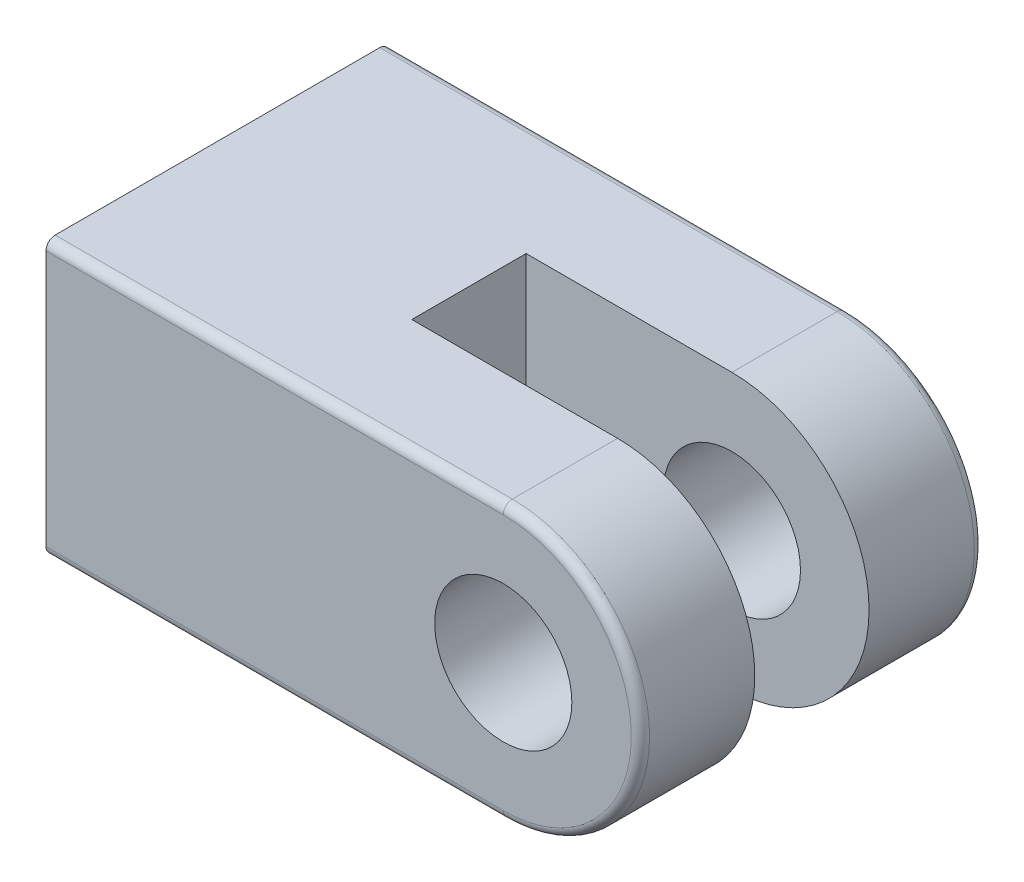
ISO-10303-21;
HEADER;
FILE_DESCRIPTION(('STEP AP214'),'2;1');
FILE_NAME('part.step','',(''),(''),'','','');
FILE_SCHEMA(('AUTOMOTIVE_DESIGN { 1 0 10303 214 1 1 1 1 }'));
ENDSEC;
DATA;
#1=APPLICATION_CONTEXT('core data for automotive mechanical design processes');
#2=APPLICATION_PROTOCOL_DEFINITION('international standard','automotive_design',2000,#1);
#3=PRODUCT_CONTEXT('',#1,'mechanical');
#4=PRODUCT('Part','Part','',(#3));
#5=PRODUCT_RELATED_PRODUCT_CATEGORY('part','',(#4));
#6=PRODUCT_DEFINITION_FORMATION('','',#4);
#7=PRODUCT_DEFINITION_CONTEXT('part definition',#1,'design');
#8=PRODUCT_DEFINITION('design','',#6,#7);
#9=PRODUCT_DEFINITION_SHAPE('','',#8);
#10=(LENGTH_UNIT() NAMED_UNIT(*) SI_UNIT(.MILLI.,.METRE.));
#11=(NAMED_UNIT(*) PLANE_ANGLE_UNIT() SI_UNIT($,.RADIAN.));
#12=(NAMED_UNIT(*) SI_UNIT($,.STERADIAN.) SOLID_ANGLE_UNIT());
#13=UNCERTAINTY_MEASURE_WITH_UNIT(LENGTH_MEASURE(1.E-05),#10,'distance_accuracy_value','');
#14=(GEOMETRIC_REPRESENTATION_CONTEXT(3) GLOBAL_UNCERTAINTY_ASSIGNED_CONTEXT((#13)) GLOBAL_UNIT_ASSIGNED_CONTEXT((#10,
#11,#12)) REPRESENTATION_CONTEXT('',''));
#15=CARTESIAN_POINT('',(0.,0.,0.));
#16=DIRECTION('',(0.,0.,1.));
#17=DIRECTION('',(1.,0.,0.));
#18=AXIS2_PLACEMENT_3D('',#15,#16,#17);
#19=CARTESIAN_POINT('',(0.,0.,19.05));
#20=DIRECTION('',(0.,0.,-1.));
#21=DIRECTION('',(-1.,0.,0.));
#22=AXIS2_PLACEMENT_3D('',#19,#20,#21);
#23=CYLINDRICAL_SURFACE('',#22,7.62);
#24=DIRECTION('',(0.,0.,-1.));
#25=VECTOR('',#24,1.);
#26=CARTESIAN_POINT('',(0.,7.62,19.05));
#27=LINE('',#26,#25);
#28=CARTESIAN_POINT('',(0.,7.62,18.542));
#29=VERTEX_POINT('',#28);
#30=CARTESIAN_POINT('',(0.,7.62,12.7));
#31=VERTEX_POINT('',#30);
#32=EDGE_CURVE('E182',#29,#31,#27,.T.);
#33=ORIENTED_EDGE('',*,*,#32,.F.);
#34=CARTESIAN_POINT('',(0.,0.,18.542));
#35=DIRECTION('',(0.,0.,1.));
#36=DIRECTION('',(1.,0.,0.));
#37=AXIS2_PLACEMENT_3D('',#34,#35,#36);
#38=CIRCLE('',#37,7.62);
#39=CARTESIAN_POINT('',(0.,-7.62,18.542));
#40=VERTEX_POINT('',#39);
#41=EDGE_CURVE('E11',#29,#40,#38,.F.);
#42=ORIENTED_EDGE('',*,*,#41,.T.);
#43=DIRECTION('',(0.,0.,-1.));
#44=VECTOR('',#43,1.);
#45=CARTESIAN_POINT('',(0.,-7.62,19.05));
#46=LINE('',#45,#44);
#47=CARTESIAN_POINT('',(0.,-7.62,12.7));
#48=VERTEX_POINT('',#47);
#49=EDGE_CURVE('E173',#40,#48,#46,.T.);
#50=ORIENTED_EDGE('',*,*,#49,.T.);
#51=CARTESIAN_POINT('',(0.,0.,12.7));
#52=DIRECTION('',(0.,0.,1.));
#53=DIRECTION('',(1.,0.,0.));
#54=AXIS2_PLACEMENT_3D('',#51,#52,#53);
#55=CIRCLE('',#54,7.62);
#56=EDGE_CURVE('E163',#48,#31,#55,.T.);
#57=ORIENTED_EDGE('',*,*,#56,.T.);
#58=EDGE_LOOP('',(#33,#42,#50,#57));
#59=FACE_BOUND('',#58,.T.);
#60=ADVANCED_FACE('F36',(#59),#23,.T.);
#61=CARTESIAN_POINT('',(0.,-7.62,6.35));
#62=VERTEX_POINT('',#61);
#63=CARTESIAN_POINT('',(0.,-7.62,0.508000000000008));
#64=VERTEX_POINT('',#63);
#65=EDGE_CURVE('E170',#62,#64,#46,.T.);
#66=ORIENTED_EDGE('',*,*,#65,.T.);
#67=CARTESIAN_POINT('',(0.,0.,0.508000000000002));
#68=DIRECTION('',(0.,0.,1.));
#69=DIRECTION('',(1.,0.,0.));
#70=AXIS2_PLACEMENT_3D('',#67,#68,#69);
#71=CIRCLE('',#70,7.62);
#72=CARTESIAN_POINT('',(0.,7.62,0.508000000000008));
#73=VERTEX_POINT('',#72);
#74=EDGE_CURVE('E45',#64,#73,#71,.T.);
#75=ORIENTED_EDGE('',*,*,#74,.T.);
#76=CARTESIAN_POINT('',(0.,7.62,6.35));
#77=VERTEX_POINT('',#76);
#78=EDGE_CURVE('E181',#77,#73,#27,.T.);
#79=ORIENTED_EDGE('',*,*,#78,.F.);
#80=CARTESIAN_POINT('',(0.,0.,6.35));
#81=DIRECTION('',(0.,0.,-1.));
#82=DIRECTION('',(-1.,0.,0.));
#83=AXIS2_PLACEMENT_3D('',#80,#81,#82);
#84=CIRCLE('',#83,7.62);
#85=EDGE_CURVE('E134',#77,#62,#84,.T.);
#86=ORIENTED_EDGE('',*,*,#85,.T.);
#87=EDGE_LOOP('',(#66,#75,#79,#86));
#88=FACE_BOUND('',#87,.T.);
#89=ADVANCED_FACE('F254',(#88),#23,.T.);
#90=CARTESIAN_POINT('',(0.,7.62,19.05));
#91=DIRECTION('',(0.,-1.,0.));
#92=DIRECTION('',(1.,0.,0.));
#93=AXIS2_PLACEMENT_3D('',#90,#91,#92);
#94=PLANE('',#93);
#95=ORIENTED_EDGE('',*,*,#78,.T.);
#96=DIRECTION('',(-1.,0.,0.));
#97=VECTOR('',#96,1.);
#98=CARTESIAN_POINT('',(0.,7.62,0.508000000000002));
#99=LINE('',#98,#97);
#100=CARTESIAN_POINT('',(-25.4,7.62,0.508000000000008));
#101=VERTEX_POINT('',#100);
#102=EDGE_CURVE('E211',#73,#101,#99,.T.);
#103=ORIENTED_EDGE('',*,*,#102,.T.);
#104=DIRECTION('',(0.,0.,-1.));
#105=VECTOR('',#104,1.);
#106=CARTESIAN_POINT('',(-25.4,7.62,19.05));
#107=LINE('',#106,#105);
#108=CARTESIAN_POINT('',(-25.4,7.62,18.542));
#109=VERTEX_POINT('',#108);
#110=EDGE_CURVE('E178',#109,#101,#107,.T.);
#111=ORIENTED_EDGE('',*,*,#110,.F.);
#112=DIRECTION('',(-1.,0.,0.));
#113=VECTOR('',#112,1.);
#114=CARTESIAN_POINT('',(0.,7.62,18.542));
#115=LINE('',#114,#113);
#116=EDGE_CURVE('E209',#109,#29,#115,.F.);
#117=ORIENTED_EDGE('',*,*,#116,.T.);
#118=ORIENTED_EDGE('',*,*,#32,.T.);
#119=DIRECTION('',(1.,0.,0.));
#120=VECTOR('',#119,1.);
#121=CARTESIAN_POINT('',(-11.43,7.62,12.7));
#122=LINE('',#121,#120);
#123=CARTESIAN_POINT('',(-11.43,7.62,12.7));
#124=VERTEX_POINT('',#123);
#125=EDGE_CURVE('E153',#124,#31,#122,.T.);
#126=ORIENTED_EDGE('',*,*,#125,.F.);
#127=DIRECTION('',(0.,0.,1.));
#128=VECTOR('',#127,1.);
#129=CARTESIAN_POINT('',(-11.43,7.62,6.35));
#130=LINE('',#129,#128);
#131=CARTESIAN_POINT('',(-11.43,7.62,6.35));
#132=VERTEX_POINT('',#131);
#133=EDGE_CURVE('E139',#132,#124,#130,.T.);
#134=ORIENTED_EDGE('',*,*,#133,.F.);
#135=DIRECTION('',(-1.,0.,0.));
#136=VECTOR('',#135,1.);
#137=CARTESIAN_POINT('',(7.62,7.62,6.35));
#138=LINE('',#137,#136);
#139=EDGE_CURVE('E128',#77,#132,#138,.T.);
#140=ORIENTED_EDGE('',*,*,#139,.F.);
#141=EDGE_LOOP('',(#95,#103,#111,#117,#118,#126,#134,#140));
#142=FACE_BOUND('',#141,.T.);
#143=ADVANCED_FACE('F151',(#142),#94,.F.);
#144=CARTESIAN_POINT('',(-25.4,7.62,19.05));
#145=DIRECTION('',(1.,0.,0.));
#146=DIRECTION('',(0.,0.,-1.));
#147=AXIS2_PLACEMENT_3D('',#144,#145,#146);
#148=PLANE('',#147);
#149=DIRECTION('',(0.,-1.,0.));
#150=VECTOR('',#149,1.);
#151=CARTESIAN_POINT('',(-25.4,7.62,0.));
#152=LINE('',#151,#150);
#153=CARTESIAN_POINT('',(-25.4,7.112,0.));
#154=VERTEX_POINT('',#153);
#155=CARTESIAN_POINT('',(-25.4,-7.112,0.));
#156=VERTEX_POINT('',#155);
#157=EDGE_CURVE('E166',#154,#156,#152,.T.);
#158=ORIENTED_EDGE('',*,*,#157,.T.);
#159=CARTESIAN_POINT('',(-25.4,-7.112,0.508000000000002));
#160=DIRECTION('',(1.,0.,0.));
#161=DIRECTION('',(0.,0.,-1.));
#162=AXIS2_PLACEMENT_3D('',#159,#160,#161);
#163=CIRCLE('',#162,0.508);
#164=CARTESIAN_POINT('',(-25.4,-7.62,0.508000000000008));
#165=VERTEX_POINT('',#164);
#166=EDGE_CURVE('E207',#156,#165,#163,.F.);
#167=ORIENTED_EDGE('',*,*,#166,.T.);
#168=DIRECTION('',(0.,0.,-1.));
#169=VECTOR('',#168,1.);
#170=CARTESIAN_POINT('',(-25.4,-7.62,19.05));
#171=LINE('',#170,#169);
#172=CARTESIAN_POINT('',(-25.4,-7.62,18.542));
#173=VERTEX_POINT('',#172);
#174=EDGE_CURVE('E175',#173,#165,#171,.T.);
#175=ORIENTED_EDGE('',*,*,#174,.F.);
#176=CARTESIAN_POINT('',(-25.4,-7.112,18.542));
#177=DIRECTION('',(1.,0.,0.));
#178=DIRECTION('',(0.,0.,-1.));
#179=AXIS2_PLACEMENT_3D('',#176,#177,#178);
#180=CIRCLE('',#179,0.508);
#181=CARTESIAN_POINT('',(-25.4,-7.112,19.05));
#182=VERTEX_POINT('',#181);
#183=EDGE_CURVE('E203',#173,#182,#180,.F.);
#184=ORIENTED_EDGE('',*,*,#183,.T.);
#185=DIRECTION('',(0.,-1.,0.));
#186=VECTOR('',#185,1.);
#187=CARTESIAN_POINT('',(-25.4,7.62,19.05));
#188=LINE('',#187,#186);
#189=CARTESIAN_POINT('',(-25.4,7.112,19.05));
#190=VERTEX_POINT('',#189);
#191=EDGE_CURVE('E167',#190,#182,#188,.T.);
#192=ORIENTED_EDGE('',*,*,#191,.F.);
#193=CARTESIAN_POINT('',(-25.4,7.112,18.542));
#194=DIRECTION('',(1.,0.,0.));
#195=DIRECTION('',(0.,0.,-1.));
#196=AXIS2_PLACEMENT_3D('',#193,#194,#195);
#197=CIRCLE('',#196,0.508);
#198=EDGE_CURVE('E201',#190,#109,#197,.F.);
#199=ORIENTED_EDGE('',*,*,#198,.T.);
#200=ORIENTED_EDGE('',*,*,#110,.T.);
#201=CARTESIAN_POINT('',(-25.4,7.112,0.508000000000002));
#202=DIRECTION('',(1.,0.,0.));
#203=DIRECTION('',(0.,0.,-1.));
#204=AXIS2_PLACEMENT_3D('',#201,#202,#203);
#205=CIRCLE('',#204,0.508);
#206=EDGE_CURVE('E205',#101,#154,#205,.F.);
#207=ORIENTED_EDGE('',*,*,#206,.T.);
#208=EDGE_LOOP('',(#158,#167,#175,#184,#192,#199,#200,#207));
#209=FACE_BOUND('',#208,.T.);
#210=ADVANCED_FACE('F236',(#209),#148,.F.);
#211=CARTESIAN_POINT('',(-25.4,-7.62,19.05));
#212=DIRECTION('',(0.,1.,0.));
#213=DIRECTION('',(0.,0.,1.));
#214=AXIS2_PLACEMENT_3D('',#211,#212,#213);
#215=PLANE('',#214);
#216=ORIENTED_EDGE('',*,*,#174,.T.);
#217=DIRECTION('',(1.,0.,0.));
#218=VECTOR('',#217,1.);
#219=CARTESIAN_POINT('',(-25.4,-7.62,0.508000000000002));
#220=LINE('',#219,#218);
#221=EDGE_CURVE('E192',#165,#64,#220,.T.);
#222=ORIENTED_EDGE('',*,*,#221,.T.);
#223=ORIENTED_EDGE('',*,*,#65,.F.);
#224=DIRECTION('',(-1.,0.,0.));
#225=VECTOR('',#224,1.);
#226=CARTESIAN_POINT('',(-25.4,-7.62,6.35));
#227=LINE('',#226,#225);
#228=CARTESIAN_POINT('',(-11.43,-7.62,6.35));
#229=VERTEX_POINT('',#228);
#230=EDGE_CURVE('E184',#62,#229,#227,.T.);
#231=ORIENTED_EDGE('',*,*,#230,.T.);
#232=DIRECTION('',(0.,0.,1.));
#233=VECTOR('',#232,1.);
#234=CARTESIAN_POINT('',(-11.43,-7.62,6.35));
#235=LINE('',#234,#233);
#236=CARTESIAN_POINT('',(-11.43,-7.62,12.7));
#237=VERTEX_POINT('',#236);
#238=EDGE_CURVE('E147',#229,#237,#235,.T.);
#239=ORIENTED_EDGE('',*,*,#238,.T.);
#240=DIRECTION('',(1.,0.,0.));
#241=VECTOR('',#240,1.);
#242=CARTESIAN_POINT('',(-11.43,-7.62,12.7));
#243=LINE('',#242,#241);
#244=EDGE_CURVE('E149',#237,#48,#243,.T.);
#245=ORIENTED_EDGE('',*,*,#244,.T.);
#246=ORIENTED_EDGE('',*,*,#49,.F.);
#247=DIRECTION('',(1.,0.,0.));
#248=VECTOR('',#247,1.);
#249=CARTESIAN_POINT('',(-25.4,-7.62,18.542));
#250=LINE('',#249,#248);
#251=EDGE_CURVE('E186',#40,#173,#250,.F.);
#252=ORIENTED_EDGE('',*,*,#251,.T.);
#253=EDGE_LOOP('',(#216,#222,#223,#231,#239,#245,#246,#252));
#254=FACE_BOUND('',#253,.T.);
#255=ADVANCED_FACE('F243',(#254),#215,.F.);
#256=CARTESIAN_POINT('',(0.,0.,19.05));
#257=DIRECTION('',(0.,0.,1.));
#258=DIRECTION('',(1.,0.,0.));
#259=AXIS2_PLACEMENT_3D('',#256,#257,#258);
#260=PLANE('',#259);
#261=ORIENTED_EDGE('',*,*,#191,.T.);
#262=DIRECTION('',(1.,0.,0.));
#263=VECTOR('',#262,1.);
#264=CARTESIAN_POINT('',(0.,-7.112,19.05));
#265=LINE('',#264,#263);
#266=CARTESIAN_POINT('',(0.,-7.112,19.05));
#267=VERTEX_POINT('',#266);
#268=EDGE_CURVE('E216',#182,#267,#265,.T.);
#269=ORIENTED_EDGE('',*,*,#268,.T.);
#270=CARTESIAN_POINT('',(0.,0.,19.05));
#271=DIRECTION('',(0.,0.,1.));
#272=DIRECTION('',(1.,0.,0.));
#273=AXIS2_PLACEMENT_3D('',#270,#271,#272);
#274=CIRCLE('',#273,7.112);
#275=CARTESIAN_POINT('',(0.,7.112,19.05));
#276=VERTEX_POINT('',#275);
#277=EDGE_CURVE('E53',#267,#276,#274,.T.);
#278=ORIENTED_EDGE('',*,*,#277,.T.);
#279=DIRECTION('',(-1.,0.,0.));
#280=VECTOR('',#279,1.);
#281=CARTESIAN_POINT('',(-25.4,7.112,19.05));
#282=LINE('',#281,#280);
#283=EDGE_CURVE('E214',#276,#190,#282,.T.);
#284=ORIENTED_EDGE('',*,*,#283,.T.);
#285=EDGE_LOOP('',(#261,#269,#278,#284));
#286=FACE_BOUND('',#285,.T.);
#287=CARTESIAN_POINT('',(0.,0.,19.05));
#288=DIRECTION('',(0.,0.,1.));
#289=DIRECTION('',(1.,0.,0.));
#290=AXIS2_PLACEMENT_3D('',#287,#288,#289);
#291=CIRCLE('',#290,3.81);
#292=CARTESIAN_POINT('',(3.81,0.,19.05));
#293=VERTEX_POINT('',#292);
#294=EDGE_CURVE('E223',#293,#293,#291,.T.);
#295=ORIENTED_EDGE('',*,*,#294,.F.);
#296=EDGE_LOOP('',(#295));
#297=FACE_BOUND('',#296,.T.);
#298=ADVANCED_FACE('F233',(#286,#297),#260,.T.);
#299=CARTESIAN_POINT('',(0.,0.,0.));
#300=DIRECTION('',(0.,0.,1.));
#301=DIRECTION('',(1.,0.,0.));
#302=AXIS2_PLACEMENT_3D('',#299,#300,#301);
#303=PLANE('',#302);
#304=CARTESIAN_POINT('',(0.,0.,0.));
#305=DIRECTION('',(0.,0.,1.));
#306=DIRECTION('',(1.,0.,0.));
#307=AXIS2_PLACEMENT_3D('',#304,#305,#306);
#308=CIRCLE('',#307,3.81);
#309=CARTESIAN_POINT('',(3.81,0.,0.));
#310=VERTEX_POINT('',#309);
#311=EDGE_CURVE('E190',#310,#310,#308,.T.);
#312=ORIENTED_EDGE('',*,*,#311,.T.);
#313=EDGE_LOOP('',(#312));
#314=FACE_BOUND('',#313,.T.);
#315=CARTESIAN_POINT('',(0.,0.,0.));
#316=DIRECTION('',(0.,0.,1.));
#317=DIRECTION('',(1.,0.,0.));
#318=AXIS2_PLACEMENT_3D('',#315,#316,#317);
#319=CIRCLE('',#318,7.112);
#320=CARTESIAN_POINT('',(0.,7.112,0.));
#321=VERTEX_POINT('',#320);
#322=CARTESIAN_POINT('',(0.,-7.112,0.));
#323=VERTEX_POINT('',#322);
#324=EDGE_CURVE('E195',#321,#323,#319,.F.);
#325=ORIENTED_EDGE('',*,*,#324,.T.);
#326=DIRECTION('',(1.,0.,0.));
#327=VECTOR('',#326,1.);
#328=CARTESIAN_POINT('',(0.,-7.112,0.));
#329=LINE('',#328,#327);
#330=EDGE_CURVE('E199',#323,#156,#329,.F.);
#331=ORIENTED_EDGE('',*,*,#330,.T.);
#332=ORIENTED_EDGE('',*,*,#157,.F.);
#333=DIRECTION('',(-1.,0.,0.));
#334=VECTOR('',#333,1.);
#335=CARTESIAN_POINT('',(0.,7.112,0.));
#336=LINE('',#335,#334);
#337=EDGE_CURVE('E197',#154,#321,#336,.F.);
#338=ORIENTED_EDGE('',*,*,#337,.T.);
#339=EDGE_LOOP('',(#325,#331,#332,#338));
#340=FACE_BOUND('',#339,.T.);
#341=ADVANCED_FACE('F268',(#314,#340),#303,.F.);
#342=CARTESIAN_POINT('',(-11.43,-7.62,12.7));
#343=DIRECTION('',(0.,0.,1.));
#344=DIRECTION('',(1.,0.,0.));
#345=AXIS2_PLACEMENT_3D('',#342,#343,#344);
#346=PLANE('',#345);
#347=CARTESIAN_POINT('',(0.,0.,12.7));
#348=DIRECTION('',(0.,0.,1.));
#349=DIRECTION('',(1.,0.,0.));
#350=AXIS2_PLACEMENT_3D('',#347,#348,#349);
#351=CIRCLE('',#350,3.81);
#352=CARTESIAN_POINT('',(3.81,0.,12.7));
#353=VERTEX_POINT('',#352);
#354=EDGE_CURVE('E140',#353,#353,#351,.T.);
#355=ORIENTED_EDGE('',*,*,#354,.T.);
#356=EDGE_LOOP('',(#355));
#357=FACE_BOUND('',#356,.T.);
#358=ORIENTED_EDGE('',*,*,#56,.F.);
#359=ORIENTED_EDGE('',*,*,#244,.F.);
#360=DIRECTION('',(0.,1.,0.));
#361=VECTOR('',#360,1.);
#362=CARTESIAN_POINT('',(-11.43,-7.62,12.7));
#363=LINE('',#362,#361);
#364=EDGE_CURVE('E148',#237,#124,#363,.T.);
#365=ORIENTED_EDGE('',*,*,#364,.T.);
#366=ORIENTED_EDGE('',*,*,#125,.T.);
#367=EDGE_LOOP('',(#358,#359,#365,#366));
#368=FACE_BOUND('',#367,.T.);
#369=ADVANCED_FACE('F250',(#357,#368),#346,.F.);
#370=CARTESIAN_POINT('',(7.62,-7.62,6.35));
#371=DIRECTION('',(0.,0.,-1.));
#372=DIRECTION('',(-1.,0.,0.));
#373=AXIS2_PLACEMENT_3D('',#370,#371,#372);
#374=PLANE('',#373);
#375=CARTESIAN_POINT('',(0.,0.,6.35));
#376=DIRECTION('',(0.,0.,-1.));
#377=DIRECTION('',(-1.,0.,0.));
#378=AXIS2_PLACEMENT_3D('',#375,#376,#377);
#379=CIRCLE('',#378,3.81);
#380=CARTESIAN_POINT('',(-3.81,0.,6.35));
#381=VERTEX_POINT('',#380);
#382=EDGE_CURVE('E187',#381,#381,#379,.T.);
#383=ORIENTED_EDGE('',*,*,#382,.T.);
#384=EDGE_LOOP('',(#383));
#385=FACE_BOUND('',#384,.T.);
#386=ORIENTED_EDGE('',*,*,#139,.T.);
#387=DIRECTION('',(0.,1.,0.));
#388=VECTOR('',#387,1.);
#389=CARTESIAN_POINT('',(-11.43,-7.62,6.35));
#390=LINE('',#389,#388);
#391=EDGE_CURVE('E132',#229,#132,#390,.T.);
#392=ORIENTED_EDGE('',*,*,#391,.F.);
#393=ORIENTED_EDGE('',*,*,#230,.F.);
#394=ORIENTED_EDGE('',*,*,#85,.F.);
#395=EDGE_LOOP('',(#386,#392,#393,#394));
#396=FACE_BOUND('',#395,.T.);
#397=ADVANCED_FACE('F130',(#385,#396),#374,.F.);
#398=CARTESIAN_POINT('',(-11.43,-7.62,6.35));
#399=DIRECTION('',(-1.,0.,0.));
#400=DIRECTION('',(0.,0.,1.));
#401=AXIS2_PLACEMENT_3D('',#398,#399,#400);
#402=PLANE('',#401);
#403=ORIENTED_EDGE('',*,*,#364,.F.);
#404=ORIENTED_EDGE('',*,*,#238,.F.);
#405=ORIENTED_EDGE('',*,*,#391,.T.);
#406=ORIENTED_EDGE('',*,*,#133,.T.);
#407=EDGE_LOOP('',(#403,#404,#405,#406));
#408=FACE_BOUND('',#407,.T.);
#409=ADVANCED_FACE('F144',(#408),#402,.F.);
#410=CARTESIAN_POINT('',(0.,0.,0.));
#411=DIRECTION('',(0.,0.,1.));
#412=DIRECTION('',(1.,0.,0.));
#413=AXIS2_PLACEMENT_3D('',#410,#411,#412);
#414=CYLINDRICAL_SURFACE('',#413,3.81);
#415=ORIENTED_EDGE('',*,*,#311,.F.);
#416=EDGE_LOOP('',(#415));
#417=FACE_BOUND('',#416,.T.);
#418=ORIENTED_EDGE('',*,*,#382,.F.);
#419=EDGE_LOOP('',(#418));
#420=FACE_BOUND('',#419,.T.);
#421=ADVANCED_FACE('F302',(#417,#420),#414,.F.);
#422=ORIENTED_EDGE('',*,*,#294,.T.);
#423=EDGE_LOOP('',(#422));
#424=FACE_BOUND('',#423,.T.);
#425=ORIENTED_EDGE('',*,*,#354,.F.);
#426=EDGE_LOOP('',(#425));
#427=FACE_BOUND('',#426,.T.);
#428=ADVANCED_FACE('F306',(#424,#427),#414,.F.);
#429=CARTESIAN_POINT('',(0.,7.112,0.508000000000002));
#430=DIRECTION('',(-1.,0.,0.));
#431=DIRECTION('',(0.,-1.,0.));
#432=AXIS2_PLACEMENT_3D('',#429,#430,#431);
#433=CYLINDRICAL_SURFACE('',#432,0.508);
#434=ORIENTED_EDGE('',*,*,#206,.F.);
#435=ORIENTED_EDGE('',*,*,#102,.F.);
#436=CARTESIAN_POINT('',(0.,7.112,0.508));
#437=DIRECTION('',(1.,0.,0.));
#438=DIRECTION('',(0.,1.,0.));
#439=AXIS2_PLACEMENT_3D('',#436,#437,#438);
#440=CIRCLE('',#439,0.508);
#441=EDGE_CURVE('E221',#321,#73,#440,.T.);
#442=ORIENTED_EDGE('',*,*,#441,.F.);
#443=ORIENTED_EDGE('',*,*,#337,.F.);
#444=EDGE_LOOP('',(#434,#435,#442,#443));
#445=FACE_BOUND('',#444,.T.);
#446=ADVANCED_FACE('F260',(#445),#433,.T.);
#447=CARTESIAN_POINT('',(0.,0.,0.508000000000002));
#448=DIRECTION('',(0.,0.,1.));
#449=DIRECTION('',(1.,0.,0.));
#450=AXIS2_PLACEMENT_3D('',#447,#448,#449);
#451=TOROIDAL_SURFACE('',#450,7.112,0.508);
#452=ORIENTED_EDGE('',*,*,#441,.T.);
#453=ORIENTED_EDGE('',*,*,#74,.F.);
#454=CARTESIAN_POINT('',(0.,-7.112,0.508));
#455=DIRECTION('',(-1.,0.,0.));
#456=DIRECTION('',(0.,0.,1.));
#457=AXIS2_PLACEMENT_3D('',#454,#455,#456);
#458=CIRCLE('',#457,0.508);
#459=EDGE_CURVE('E219',#323,#64,#458,.T.);
#460=ORIENTED_EDGE('',*,*,#459,.F.);
#461=ORIENTED_EDGE('',*,*,#324,.F.);
#462=EDGE_LOOP('',(#452,#453,#460,#461));
#463=FACE_BOUND('',#462,.T.);
#464=ADVANCED_FACE('F264',(#463),#451,.T.);
#465=CARTESIAN_POINT('',(-25.4,-7.112,0.508000000000002));
#466=DIRECTION('',(1.,0.,0.));
#467=DIRECTION('',(0.,0.,-1.));
#468=AXIS2_PLACEMENT_3D('',#465,#466,#467);
#469=CYLINDRICAL_SURFACE('',#468,0.508);
#470=ORIENTED_EDGE('',*,*,#166,.F.);
#471=ORIENTED_EDGE('',*,*,#330,.F.);
#472=ORIENTED_EDGE('',*,*,#459,.T.);
#473=ORIENTED_EDGE('',*,*,#221,.F.);
#474=EDGE_LOOP('',(#470,#471,#472,#473));
#475=FACE_BOUND('',#474,.T.);
#476=ADVANCED_FACE('F272',(#475),#469,.T.);
#477=CARTESIAN_POINT('',(0.,7.112,18.542));
#478=DIRECTION('',(1.,0.,0.));
#479=DIRECTION('',(0.,1.,0.));
#480=AXIS2_PLACEMENT_3D('',#477,#478,#479);
#481=CYLINDRICAL_SURFACE('',#480,0.508);
#482=ORIENTED_EDGE('',*,*,#198,.F.);
#483=ORIENTED_EDGE('',*,*,#283,.F.);
#484=CARTESIAN_POINT('',(0.,7.112,18.542));
#485=DIRECTION('',(1.,0.,0.));
#486=DIRECTION('',(0.,1.,0.));
#487=AXIS2_PLACEMENT_3D('',#484,#485,#486);
#488=CIRCLE('',#487,0.508);
#489=EDGE_CURVE('E40',#29,#276,#488,.T.);
#490=ORIENTED_EDGE('',*,*,#489,.F.);
#491=ORIENTED_EDGE('',*,*,#116,.F.);
#492=EDGE_LOOP('',(#482,#483,#490,#491));
#493=FACE_BOUND('',#492,.T.);
#494=ADVANCED_FACE('F38',(#493),#481,.T.);
#495=CARTESIAN_POINT('',(0.,0.,18.542));
#496=DIRECTION('',(0.,0.,1.));
#497=DIRECTION('',(1.,0.,0.));
#498=AXIS2_PLACEMENT_3D('',#495,#496,#497);
#499=TOROIDAL_SURFACE('',#498,7.112,0.508);
#500=ORIENTED_EDGE('',*,*,#489,.T.);
#501=ORIENTED_EDGE('',*,*,#277,.F.);
#502=CARTESIAN_POINT('',(0.,-7.112,18.542));
#503=DIRECTION('',(-1.,0.,0.));
#504=DIRECTION('',(0.,0.,1.));
#505=AXIS2_PLACEMENT_3D('',#502,#503,#504);
#506=CIRCLE('',#505,0.508);
#507=EDGE_CURVE('E61',#40,#267,#506,.T.);
#508=ORIENTED_EDGE('',*,*,#507,.F.);
#509=ORIENTED_EDGE('',*,*,#41,.F.);
#510=EDGE_LOOP('',(#500,#501,#508,#509));
#511=FACE_BOUND('',#510,.T.);
#512=ADVANCED_FACE('F228',(#511),#499,.T.);
#513=CARTESIAN_POINT('',(0.,-7.112,18.542));
#514=DIRECTION('',(-1.,0.,0.));
#515=DIRECTION('',(0.,0.,1.));
#516=AXIS2_PLACEMENT_3D('',#513,#514,#515);
#517=CYLINDRICAL_SURFACE('',#516,0.508);
#518=ORIENTED_EDGE('',*,*,#183,.F.);
#519=ORIENTED_EDGE('',*,*,#251,.F.);
#520=ORIENTED_EDGE('',*,*,#507,.T.);
#521=ORIENTED_EDGE('',*,*,#268,.F.);
#522=EDGE_LOOP('',(#518,#519,#520,#521));
#523=FACE_BOUND('',#522,.T.);
#524=ADVANCED_FACE('F240',(#523),#517,.T.);
#525=CLOSED_SHELL('',(#60,#89,#143,#210,#255,#298,#341,#369,#397,#409,#421,#428,#446,#464,#476,
#494,#512,#524));
#526=MANIFOLD_SOLID_BREP('B2',#525);
#527=ADVANCED_BREP_SHAPE_REPRESENTATION('',(#18,#526),#14);
#528=SHAPE_DEFINITION_REPRESENTATION(#9,#527);
ENDSEC;
END-ISO-10303-21;
